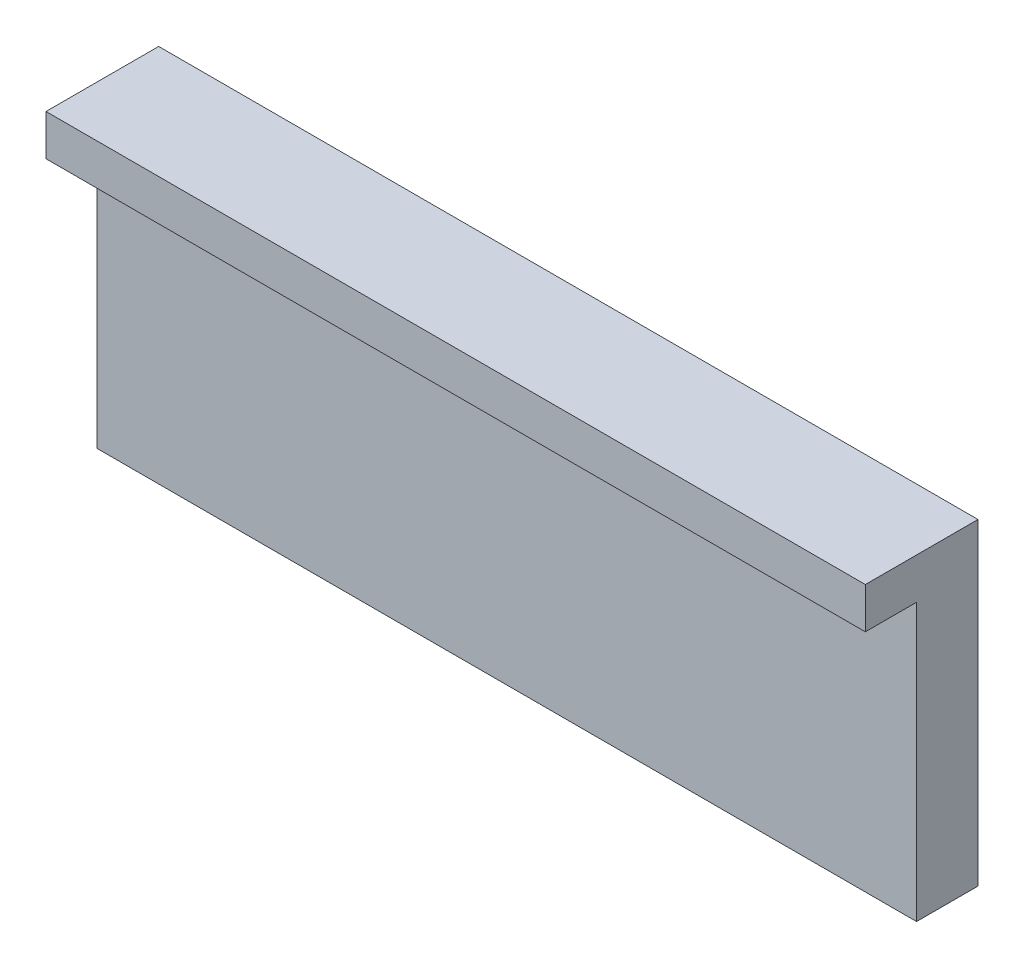
ISO-10303-21;
HEADER;
FILE_DESCRIPTION(('STEP AP214'),'2;1');
FILE_NAME('part.step','',(''),(''),'','','');
FILE_SCHEMA(('AUTOMOTIVE_DESIGN { 1 0 10303 214 1 1 1 1 }'));
ENDSEC;
DATA;
#1=APPLICATION_CONTEXT('core data for automotive mechanical design processes');
#2=APPLICATION_PROTOCOL_DEFINITION('international standard','automotive_design',2000,#1);
#3=PRODUCT_CONTEXT('',#1,'mechanical');
#4=PRODUCT('Part','Part','',(#3));
#5=PRODUCT_RELATED_PRODUCT_CATEGORY('part','',(#4));
#6=PRODUCT_DEFINITION_FORMATION('','',#4);
#7=PRODUCT_DEFINITION_CONTEXT('part definition',#1,'design');
#8=PRODUCT_DEFINITION('design','',#6,#7);
#9=PRODUCT_DEFINITION_SHAPE('','',#8);
#10=(LENGTH_UNIT() NAMED_UNIT(*) SI_UNIT(.MILLI.,.METRE.));
#11=(NAMED_UNIT(*) PLANE_ANGLE_UNIT() SI_UNIT($,.RADIAN.));
#12=(NAMED_UNIT(*) SI_UNIT($,.STERADIAN.) SOLID_ANGLE_UNIT());
#13=UNCERTAINTY_MEASURE_WITH_UNIT(LENGTH_MEASURE(1.E-05),#10,'distance_accuracy_value','');
#14=(GEOMETRIC_REPRESENTATION_CONTEXT(3) GLOBAL_UNCERTAINTY_ASSIGNED_CONTEXT((#13)) GLOBAL_UNIT_ASSIGNED_CONTEXT((#10,
#11,#12)) REPRESENTATION_CONTEXT('',''));
#15=CARTESIAN_POINT('',(0.,0.,0.));
#16=DIRECTION('',(0.,0.,1.));
#17=DIRECTION('',(1.,0.,0.));
#18=AXIS2_PLACEMENT_3D('',#15,#16,#17);
#19=CARTESIAN_POINT('',(0.,0.,6.));
#20=DIRECTION('',(0.,0.,-1.));
#21=DIRECTION('',(-1.,0.,0.));
#22=AXIS2_PLACEMENT_3D('',#19,#20,#21);
#23=PLANE('',#22);
#24=DIRECTION('',(1.,0.,0.));
#25=VECTOR('',#24,1.);
#26=CARTESIAN_POINT('',(0.,27.,6.));
#27=LINE('',#26,#25);
#28=CARTESIAN_POINT('',(0.,27.,6.));
#29=VERTEX_POINT('',#28);
#30=CARTESIAN_POINT('',(80.,27.,6.));
#31=VERTEX_POINT('',#30);
#32=EDGE_CURVE('E47',#29,#31,#27,.T.);
#33=ORIENTED_EDGE('',*,*,#32,.F.);
#34=DIRECTION('',(0.,-1.,0.));
#35=VECTOR('',#34,1.);
#36=CARTESIAN_POINT('',(0.,31.,6.));
#37=LINE('',#36,#35);
#38=CARTESIAN_POINT('',(0.,0.,6.));
#39=VERTEX_POINT('',#38);
#40=EDGE_CURVE('E132',#29,#39,#37,.T.);
#41=ORIENTED_EDGE('',*,*,#40,.T.);
#42=DIRECTION('',(1.,0.,0.));
#43=VECTOR('',#42,1.);
#44=CARTESIAN_POINT('',(80.,0.,6.));
#45=LINE('',#44,#43);
#46=CARTESIAN_POINT('',(80.,0.,6.));
#47=VERTEX_POINT('',#46);
#48=EDGE_CURVE('E53',#39,#47,#45,.T.);
#49=ORIENTED_EDGE('',*,*,#48,.T.);
#50=DIRECTION('',(0.,1.,0.));
#51=VECTOR('',#50,1.);
#52=CARTESIAN_POINT('',(80.,31.,6.));
#53=LINE('',#52,#51);
#54=EDGE_CURVE('E82',#47,#31,#53,.T.);
#55=ORIENTED_EDGE('',*,*,#54,.T.);
#56=EDGE_LOOP('',(#33,#41,#49,#55));
#57=FACE_BOUND('',#56,.T.);
#58=ADVANCED_FACE('F32',(#57),#23,.F.);
#59=CARTESIAN_POINT('',(80.,31.,6.));
#60=DIRECTION('',(-1.,0.,0.));
#61=DIRECTION('',(0.,0.,1.));
#62=AXIS2_PLACEMENT_3D('',#59,#60,#61);
#63=PLANE('',#62);
#64=DIRECTION('',(0.,1.,0.));
#65=VECTOR('',#64,1.);
#66=CARTESIAN_POINT('',(80.,31.,0.));
#67=LINE('',#66,#65);
#68=CARTESIAN_POINT('',(80.,0.,0.));
#69=VERTEX_POINT('',#68);
#70=CARTESIAN_POINT('',(80.,31.,0.));
#71=VERTEX_POINT('',#70);
#72=EDGE_CURVE('E88',#69,#71,#67,.T.);
#73=ORIENTED_EDGE('',*,*,#72,.T.);
#74=DIRECTION('',(0.,0.,-1.));
#75=VECTOR('',#74,1.);
#76=CARTESIAN_POINT('',(80.,31.,6.));
#77=LINE('',#76,#75);
#78=CARTESIAN_POINT('',(80.,31.,11.));
#79=VERTEX_POINT('',#78);
#80=EDGE_CURVE('E11',#79,#71,#77,.T.);
#81=ORIENTED_EDGE('',*,*,#80,.F.);
#82=DIRECTION('',(0.,1.,0.));
#83=VECTOR('',#82,1.);
#84=CARTESIAN_POINT('',(80.,31.,11.));
#85=LINE('',#84,#83);
#86=CARTESIAN_POINT('',(80.,27.,11.));
#87=VERTEX_POINT('',#86);
#88=EDGE_CURVE('E124',#87,#79,#85,.T.);
#89=ORIENTED_EDGE('',*,*,#88,.F.);
#90=DIRECTION('',(0.,0.,-1.));
#91=VECTOR('',#90,1.);
#92=CARTESIAN_POINT('',(80.,27.,11.));
#93=LINE('',#92,#91);
#94=EDGE_CURVE('E97',#87,#31,#93,.T.);
#95=ORIENTED_EDGE('',*,*,#94,.T.);
#96=ORIENTED_EDGE('',*,*,#54,.F.);
#97=DIRECTION('',(0.,0.,-1.));
#98=VECTOR('',#97,1.);
#99=CARTESIAN_POINT('',(80.,0.,6.));
#100=LINE('',#99,#98);
#101=EDGE_CURVE('E75',#47,#69,#100,.T.);
#102=ORIENTED_EDGE('',*,*,#101,.T.);
#103=EDGE_LOOP('',(#73,#81,#89,#95,#96,#102));
#104=FACE_BOUND('',#103,.T.);
#105=ADVANCED_FACE('F34',(#104),#63,.F.);
#106=CARTESIAN_POINT('',(80.,31.,6.));
#107=DIRECTION('',(0.,-1.,0.));
#108=DIRECTION('',(1.,0.,0.));
#109=AXIS2_PLACEMENT_3D('',#106,#107,#108);
#110=PLANE('',#109);
#111=DIRECTION('',(-1.,0.,0.));
#112=VECTOR('',#111,1.);
#113=CARTESIAN_POINT('',(80.,31.,0.));
#114=LINE('',#113,#112);
#115=CARTESIAN_POINT('',(0.,31.,0.));
#116=VERTEX_POINT('',#115);
#117=EDGE_CURVE('E92',#71,#116,#114,.T.);
#118=ORIENTED_EDGE('',*,*,#117,.T.);
#119=DIRECTION('',(0.,0.,-1.));
#120=VECTOR('',#119,1.);
#121=CARTESIAN_POINT('',(0.,31.,6.));
#122=LINE('',#121,#120);
#123=CARTESIAN_POINT('',(0.,31.,11.));
#124=VERTEX_POINT('',#123);
#125=EDGE_CURVE('E40',#124,#116,#122,.T.);
#126=ORIENTED_EDGE('',*,*,#125,.F.);
#127=DIRECTION('',(-1.,0.,0.));
#128=VECTOR('',#127,1.);
#129=CARTESIAN_POINT('',(0.,31.,11.));
#130=LINE('',#129,#128);
#131=EDGE_CURVE('E116',#79,#124,#130,.T.);
#132=ORIENTED_EDGE('',*,*,#131,.F.);
#133=ORIENTED_EDGE('',*,*,#80,.T.);
#134=EDGE_LOOP('',(#118,#126,#132,#133));
#135=FACE_BOUND('',#134,.T.);
#136=ADVANCED_FACE('F114',(#135),#110,.F.);
#137=CARTESIAN_POINT('',(0.,31.,6.));
#138=DIRECTION('',(1.,0.,0.));
#139=DIRECTION('',(0.,1.,0.));
#140=AXIS2_PLACEMENT_3D('',#137,#138,#139);
#141=PLANE('',#140);
#142=DIRECTION('',(0.,-1.,0.));
#143=VECTOR('',#142,1.);
#144=CARTESIAN_POINT('',(0.,31.,0.));
#145=LINE('',#144,#143);
#146=CARTESIAN_POINT('',(0.,0.,0.));
#147=VERTEX_POINT('',#146);
#148=EDGE_CURVE('E83',#116,#147,#145,.T.);
#149=ORIENTED_EDGE('',*,*,#148,.T.);
#150=DIRECTION('',(0.,0.,-1.));
#151=VECTOR('',#150,1.);
#152=CARTESIAN_POINT('',(0.,0.,6.));
#153=LINE('',#152,#151);
#154=EDGE_CURVE('E78',#39,#147,#153,.T.);
#155=ORIENTED_EDGE('',*,*,#154,.F.);
#156=ORIENTED_EDGE('',*,*,#40,.F.);
#157=DIRECTION('',(0.,0.,-1.));
#158=VECTOR('',#157,1.);
#159=CARTESIAN_POINT('',(0.,27.,11.));
#160=LINE('',#159,#158);
#161=CARTESIAN_POINT('',(0.,27.,11.));
#162=VERTEX_POINT('',#161);
#163=EDGE_CURVE('E93',#162,#29,#160,.T.);
#164=ORIENTED_EDGE('',*,*,#163,.F.);
#165=DIRECTION('',(0.,-1.,0.));
#166=VECTOR('',#165,1.);
#167=CARTESIAN_POINT('',(0.,31.,11.));
#168=LINE('',#167,#166);
#169=EDGE_CURVE('E110',#124,#162,#168,.T.);
#170=ORIENTED_EDGE('',*,*,#169,.F.);
#171=ORIENTED_EDGE('',*,*,#125,.T.);
#172=EDGE_LOOP('',(#149,#155,#156,#164,#170,#171));
#173=FACE_BOUND('',#172,.T.);
#174=ADVANCED_FACE('F107',(#173),#141,.F.);
#175=CARTESIAN_POINT('',(80.,0.,6.));
#176=DIRECTION('',(0.,1.,0.));
#177=DIRECTION('',(-1.,0.,0.));
#178=AXIS2_PLACEMENT_3D('',#175,#176,#177);
#179=PLANE('',#178);
#180=DIRECTION('',(1.,0.,0.));
#181=VECTOR('',#180,1.);
#182=CARTESIAN_POINT('',(80.,0.,0.));
#183=LINE('',#182,#181);
#184=EDGE_CURVE('E72',#147,#69,#183,.T.);
#185=ORIENTED_EDGE('',*,*,#184,.T.);
#186=ORIENTED_EDGE('',*,*,#101,.F.);
#187=ORIENTED_EDGE('',*,*,#48,.F.);
#188=ORIENTED_EDGE('',*,*,#154,.T.);
#189=EDGE_LOOP('',(#185,#186,#187,#188));
#190=FACE_BOUND('',#189,.T.);
#191=ADVANCED_FACE('F74',(#190),#179,.F.);
#192=CARTESIAN_POINT('',(0.,0.,0.));
#193=DIRECTION('',(0.,0.,-1.));
#194=DIRECTION('',(-1.,0.,0.));
#195=AXIS2_PLACEMENT_3D('',#192,#193,#194);
#196=PLANE('',#195);
#197=ORIENTED_EDGE('',*,*,#72,.F.);
#198=ORIENTED_EDGE('',*,*,#184,.F.);
#199=ORIENTED_EDGE('',*,*,#148,.F.);
#200=ORIENTED_EDGE('',*,*,#117,.F.);
#201=EDGE_LOOP('',(#197,#198,#199,#200));
#202=FACE_BOUND('',#201,.T.);
#203=ADVANCED_FACE('F91',(#202),#196,.T.);
#204=CARTESIAN_POINT('',(0.,27.,11.));
#205=DIRECTION('',(0.,1.,0.));
#206=DIRECTION('',(0.,0.,1.));
#207=AXIS2_PLACEMENT_3D('',#204,#205,#206);
#208=PLANE('',#207);
#209=ORIENTED_EDGE('',*,*,#32,.T.);
#210=ORIENTED_EDGE('',*,*,#94,.F.);
#211=DIRECTION('',(1.,0.,0.));
#212=VECTOR('',#211,1.);
#213=CARTESIAN_POINT('',(0.,27.,11.));
#214=LINE('',#213,#212);
#215=EDGE_CURVE('E127',#162,#87,#214,.T.);
#216=ORIENTED_EDGE('',*,*,#215,.F.);
#217=ORIENTED_EDGE('',*,*,#163,.T.);
#218=EDGE_LOOP('',(#209,#210,#216,#217));
#219=FACE_BOUND('',#218,.T.);
#220=ADVANCED_FACE('F135',(#219),#208,.F.);
#221=CARTESIAN_POINT('',(0.,0.,11.));
#222=DIRECTION('',(0.,0.,1.));
#223=DIRECTION('',(1.,0.,0.));
#224=AXIS2_PLACEMENT_3D('',#221,#222,#223);
#225=PLANE('',#224);
#226=ORIENTED_EDGE('',*,*,#169,.T.);
#227=ORIENTED_EDGE('',*,*,#215,.T.);
#228=ORIENTED_EDGE('',*,*,#88,.T.);
#229=ORIENTED_EDGE('',*,*,#131,.T.);
#230=EDGE_LOOP('',(#226,#227,#228,#229));
#231=FACE_BOUND('',#230,.T.);
#232=ADVANCED_FACE('F120',(#231),#225,.T.);
#233=CLOSED_SHELL('',(#58,#105,#136,#174,#191,#203,#220,#232));
#234=MANIFOLD_SOLID_BREP('B2',#233);
#235=ADVANCED_BREP_SHAPE_REPRESENTATION('',(#18,#234),#14);
#236=SHAPE_DEFINITION_REPRESENTATION(#9,#235);
ENDSEC;
END-ISO-10303-21;
